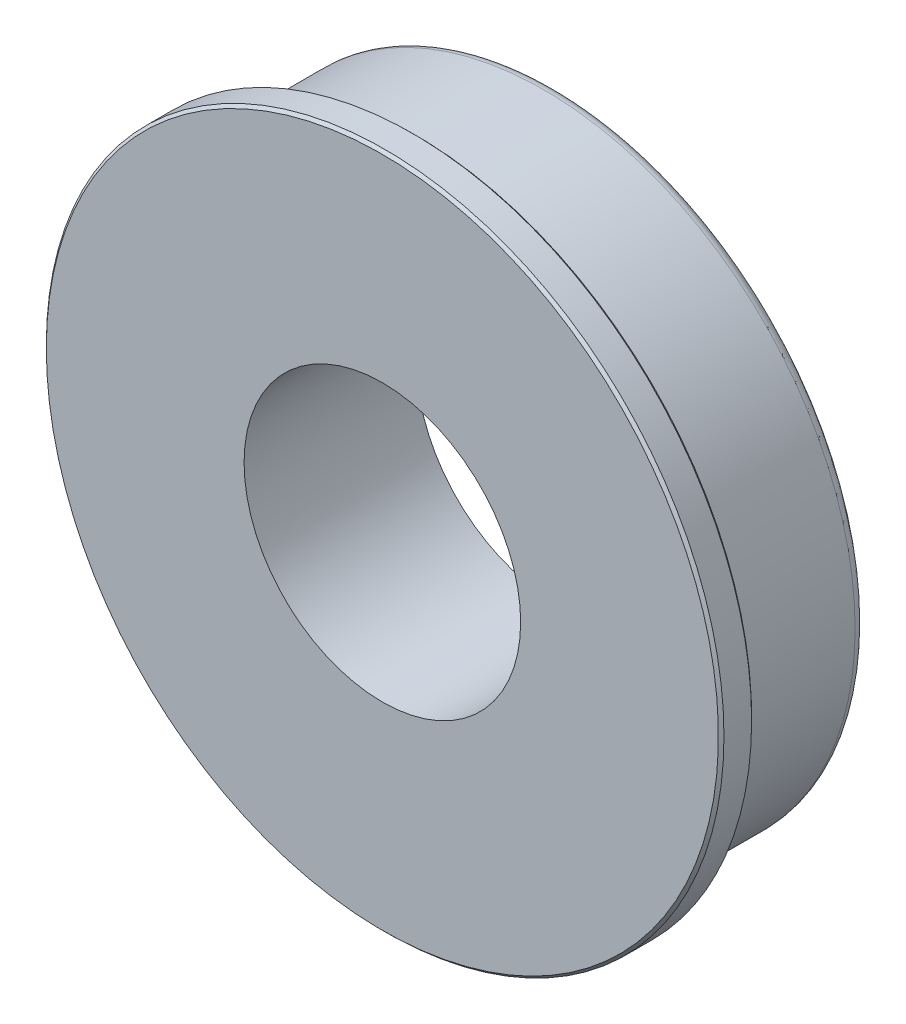
ISO-10303-21;
HEADER;
FILE_DESCRIPTION(('STEP AP214'),'2;1');
FILE_NAME('part.step','',(''),(''),'','','');
FILE_SCHEMA(('AUTOMOTIVE_DESIGN { 1 0 10303 214 1 1 1 1 }'));
ENDSEC;
DATA;
#1=APPLICATION_CONTEXT('core data for automotive mechanical design processes');
#2=APPLICATION_PROTOCOL_DEFINITION('international standard','automotive_design',2000,#1);
#3=PRODUCT_CONTEXT('',#1,'mechanical');
#4=PRODUCT('Part','Part','',(#3));
#5=PRODUCT_RELATED_PRODUCT_CATEGORY('part','',(#4));
#6=PRODUCT_DEFINITION_FORMATION('','',#4);
#7=PRODUCT_DEFINITION_CONTEXT('part definition',#1,'design');
#8=PRODUCT_DEFINITION('design','',#6,#7);
#9=PRODUCT_DEFINITION_SHAPE('','',#8);
#10=(LENGTH_UNIT() NAMED_UNIT(*) SI_UNIT(.MILLI.,.METRE.));
#11=(NAMED_UNIT(*) PLANE_ANGLE_UNIT() SI_UNIT($,.RADIAN.));
#12=(NAMED_UNIT(*) SI_UNIT($,.STERADIAN.) SOLID_ANGLE_UNIT());
#13=UNCERTAINTY_MEASURE_WITH_UNIT(LENGTH_MEASURE(1.E-05),#10,'distance_accuracy_value','');
#14=(GEOMETRIC_REPRESENTATION_CONTEXT(3) GLOBAL_UNCERTAINTY_ASSIGNED_CONTEXT((#13)) GLOBAL_UNIT_ASSIGNED_CONTEXT((#10,
#11,#12)) REPRESENTATION_CONTEXT('',''));
#15=CARTESIAN_POINT('',(0.,0.,0.));
#16=DIRECTION('',(0.,0.,1.));
#17=DIRECTION('',(1.,0.,0.));
#18=AXIS2_PLACEMENT_3D('',#15,#16,#17);
#19=CARTESIAN_POINT('',(0.,47.3069264516129,5.89534));
#20=DIRECTION('',(0.,0.,-1.));
#21=DIRECTION('',(-1.,0.,0.));
#22=AXIS2_PLACEMENT_3D('',#19,#20,#21);
#23=PLANE('',#22);
#24=CARTESIAN_POINT('',(0.,0.,5.89534));
#25=DIRECTION('',(0.,0.,1.));
#26=DIRECTION('',(1.,0.,0.));
#27=AXIS2_PLACEMENT_3D('',#24,#25,#26);
#28=CIRCLE('',#27,14.2875);
#29=CARTESIAN_POINT('',(14.2875,0.,5.89534));
#30=VERTEX_POINT('',#29);
#31=EDGE_CURVE('E47',#30,#30,#28,.F.);
#32=ORIENTED_EDGE('',*,*,#31,.F.);
#33=EDGE_LOOP('',(#32));
#34=FACE_BOUND('',#33,.T.);
#35=CARTESIAN_POINT('',(0.,0.,5.89534));
#36=DIRECTION('',(0.,0.,-1.));
#37=DIRECTION('',(-1.,0.,0.));
#38=AXIS2_PLACEMENT_3D('',#35,#36,#37);
#39=CIRCLE('',#38,13.97);
#40=CARTESIAN_POINT('',(-13.97,0.,5.89534));
#41=VERTEX_POINT('',#40);
#42=EDGE_CURVE('E20',#41,#41,#39,.F.);
#43=ORIENTED_EDGE('',*,*,#42,.F.);
#44=EDGE_LOOP('',(#43));
#45=FACE_BOUND('',#44,.T.);
#46=ADVANCED_FACE('F16',(#34,#45),#23,.F.);
#47=CARTESIAN_POINT('',(0.,0.,-57.007125));
#48=DIRECTION('',(0.,0.,-1.));
#49=DIRECTION('',(-1.,0.,0.));
#50=AXIS2_PLACEMENT_3D('',#47,#48,#49);
#51=CYLINDRICAL_SURFACE('',#50,13.97);
#52=ORIENTED_EDGE('',*,*,#42,.T.);
#53=EDGE_LOOP('',(#52));
#54=FACE_BOUND('',#53,.T.);
#55=CARTESIAN_POINT('',(0.,0.,6.40333999999999));
#56=DIRECTION('',(0.,0.,-1.));
#57=DIRECTION('',(-1.,0.,0.));
#58=AXIS2_PLACEMENT_3D('',#55,#56,#57);
#59=CIRCLE('',#58,13.97);
#60=CARTESIAN_POINT('',(-13.97,0.,6.40333999999999));
#61=VERTEX_POINT('',#60);
#62=EDGE_CURVE('E45',#61,#61,#59,.F.);
#63=ORIENTED_EDGE('',*,*,#62,.F.);
#64=EDGE_LOOP('',(#63));
#65=FACE_BOUND('',#64,.T.);
#66=ADVANCED_FACE('F54',(#54,#65),#51,.T.);
#67=CARTESIAN_POINT('',(0.,0.,6.40334));
#68=DIRECTION('',(0.,0.,1.));
#69=DIRECTION('',(1.,0.,0.));
#70=AXIS2_PLACEMENT_3D('',#67,#68,#69);
#71=CYLINDRICAL_SURFACE('',#70,14.2875);
#72=CARTESIAN_POINT('',(0.,0.,0.508));
#73=DIRECTION('',(0.,0.,-1.));
#74=DIRECTION('',(-1.,0.,0.));
#75=AXIS2_PLACEMENT_3D('',#72,#73,#74);
#76=CIRCLE('',#75,14.2875);
#77=CARTESIAN_POINT('',(-14.2875,0.,0.508));
#78=VERTEX_POINT('',#77);
#79=EDGE_CURVE('E32',#78,#78,#76,.T.);
#80=ORIENTED_EDGE('',*,*,#79,.F.);
#81=EDGE_LOOP('',(#80));
#82=FACE_BOUND('',#81,.T.);
#83=ORIENTED_EDGE('',*,*,#31,.T.);
#84=EDGE_LOOP('',(#83));
#85=FACE_BOUND('',#84,.T.);
#86=ADVANCED_FACE('F62',(#82,#85),#71,.T.);
#87=CARTESIAN_POINT('',(0.,0.,6.40334));
#88=DIRECTION('',(0.,0.,-1.));
#89=DIRECTION('',(-1.,0.,0.));
#90=AXIS2_PLACEMENT_3D('',#87,#88,#89);
#91=PLANE('',#90);
#92=CARTESIAN_POINT('',(0.,0.,6.40334000000001));
#93=DIRECTION('',(0.,0.,1.));
#94=DIRECTION('',(0.,-1.,0.));
#95=AXIS2_PLACEMENT_3D('',#92,#93,#94);
#96=CIRCLE('',#95,15.4305);
#97=CARTESIAN_POINT('',(0.,-15.4305,6.40334000000001));
#98=VERTEX_POINT('',#97);
#99=EDGE_CURVE('E42',#98,#98,#96,.T.);
#100=ORIENTED_EDGE('',*,*,#99,.F.);
#101=EDGE_LOOP('',(#100));
#102=FACE_BOUND('',#101,.T.);
#103=ORIENTED_EDGE('',*,*,#62,.T.);
#104=EDGE_LOOP('',(#103));
#105=FACE_BOUND('',#104,.T.);
#106=ADVANCED_FACE('F92',(#102,#105),#91,.T.);
#107=CARTESIAN_POINT('',(0.,0.,0.508000000000006));
#108=DIRECTION('',(0.,0.,-1.));
#109=DIRECTION('',(-1.,0.,0.));
#110=AXIS2_PLACEMENT_3D('',#107,#108,#109);
#111=TOROIDAL_SURFACE('',#110,13.7795,0.508000000000003);
#112=ORIENTED_EDGE('',*,*,#79,.T.);
#113=EDGE_LOOP('',(#112));
#114=FACE_BOUND('',#113,.T.);
#115=CARTESIAN_POINT('',(0.,0.,0.));
#116=DIRECTION('',(0.,0.,-1.));
#117=DIRECTION('',(-1.,0.,0.));
#118=AXIS2_PLACEMENT_3D('',#115,#116,#117);
#119=CIRCLE('',#118,13.7795);
#120=CARTESIAN_POINT('',(-13.7795,0.,0.));
#121=VERTEX_POINT('',#120);
#122=EDGE_CURVE('E39',#121,#121,#119,.T.);
#123=ORIENTED_EDGE('',*,*,#122,.F.);
#124=EDGE_LOOP('',(#123));
#125=FACE_BOUND('',#124,.T.);
#126=ADVANCED_FACE('F18',(#114,#125),#111,.T.);
#127=CARTESIAN_POINT('',(0.,0.,6.53034));
#128=DIRECTION('',(0.,0.,1.));
#129=DIRECTION('',(0.,-1.,0.));
#130=AXIS2_PLACEMENT_3D('',#127,#128,#129);
#131=CONICAL_SURFACE('',#130,15.5575000000007,0.785398163400003);
#132=CARTESIAN_POINT('',(0.,0.,6.53034));
#133=DIRECTION('',(0.,0.,1.));
#134=DIRECTION('',(1.,0.,0.));
#135=AXIS2_PLACEMENT_3D('',#132,#133,#134);
#136=CIRCLE('',#135,15.5575);
#137=CARTESIAN_POINT('',(15.5575,0.,6.53034));
#138=VERTEX_POINT('',#137);
#139=EDGE_CURVE('E38',#138,#138,#136,.T.);
#140=ORIENTED_EDGE('',*,*,#139,.F.);
#141=EDGE_LOOP('',(#140));
#142=FACE_BOUND('',#141,.T.);
#143=ORIENTED_EDGE('',*,*,#99,.T.);
#144=EDGE_LOOP('',(#143));
#145=FACE_BOUND('',#144,.T.);
#146=ADVANCED_FACE('F87',(#142,#145),#131,.T.);
#147=CARTESIAN_POINT('',(0.,0.,0.));
#148=DIRECTION('',(0.,0.,-1.));
#149=DIRECTION('',(-1.,0.,0.));
#150=AXIS2_PLACEMENT_3D('',#147,#148,#149);
#151=PLANE('',#150);
#152=ORIENTED_EDGE('',*,*,#122,.T.);
#153=EDGE_LOOP('',(#152));
#154=FACE_BOUND('',#153,.T.);
#155=CARTESIAN_POINT('',(0.,0.,0.));
#156=DIRECTION('',(0.,0.,-1.));
#157=DIRECTION('',(-1.,0.,0.));
#158=AXIS2_PLACEMENT_3D('',#155,#156,#157);
#159=CIRCLE('',#158,6.35);
#160=CARTESIAN_POINT('',(-6.34999999999999,0.,0.));
#161=VERTEX_POINT('',#160);
#162=EDGE_CURVE('E35',#161,#161,#159,.F.);
#163=ORIENTED_EDGE('',*,*,#162,.T.);
#164=EDGE_LOOP('',(#163));
#165=FACE_BOUND('',#164,.T.);
#166=ADVANCED_FACE('F83',(#154,#165),#151,.T.);
#167=CARTESIAN_POINT('',(0.,0.,7.92734));
#168=DIRECTION('',(0.,0.,1.));
#169=DIRECTION('',(1.,0.,0.));
#170=AXIS2_PLACEMENT_3D('',#167,#168,#169);
#171=CYLINDRICAL_SURFACE('',#170,15.5575);
#172=CARTESIAN_POINT('',(0.,0.,7.80033999999999));
#173=DIRECTION('',(0.,0.,-1.));
#174=DIRECTION('',(-1.,0.,0.));
#175=AXIS2_PLACEMENT_3D('',#172,#173,#174);
#176=CIRCLE('',#175,15.5575);
#177=CARTESIAN_POINT('',(-15.5575,0.,7.80033999999999));
#178=VERTEX_POINT('',#177);
#179=EDGE_CURVE('E29',#178,#178,#176,.F.);
#180=ORIENTED_EDGE('',*,*,#179,.F.);
#181=EDGE_LOOP('',(#180));
#182=FACE_BOUND('',#181,.T.);
#183=ORIENTED_EDGE('',*,*,#139,.T.);
#184=EDGE_LOOP('',(#183));
#185=FACE_BOUND('',#184,.T.);
#186=ADVANCED_FACE('F79',(#182,#185),#171,.T.);
#187=CARTESIAN_POINT('',(0.,0.,7.92734));
#188=DIRECTION('',(0.,0.,-1.));
#189=DIRECTION('',(-1.,0.,0.));
#190=AXIS2_PLACEMENT_3D('',#187,#188,#189);
#191=CYLINDRICAL_SURFACE('',#190,6.35);
#192=ORIENTED_EDGE('',*,*,#162,.F.);
#193=EDGE_LOOP('',(#192));
#194=FACE_BOUND('',#193,.T.);
#195=CARTESIAN_POINT('',(0.,0.,7.92734));
#196=DIRECTION('',(0.,0.,-1.));
#197=DIRECTION('',(-1.,0.,0.));
#198=AXIS2_PLACEMENT_3D('',#195,#196,#197);
#199=CIRCLE('',#198,6.35);
#200=CARTESIAN_POINT('',(-6.34999999999999,0.,7.92734));
#201=VERTEX_POINT('',#200);
#202=EDGE_CURVE('E24',#201,#201,#199,.F.);
#203=ORIENTED_EDGE('',*,*,#202,.T.);
#204=EDGE_LOOP('',(#203));
#205=FACE_BOUND('',#204,.T.);
#206=ADVANCED_FACE('F72',(#194,#205),#191,.F.);
#207=CARTESIAN_POINT('',(0.,0.,7.80033999999999));
#208=DIRECTION('',(0.,0.,-1.));
#209=DIRECTION('',(-1.,0.,0.));
#210=AXIS2_PLACEMENT_3D('',#207,#208,#209);
#211=CONICAL_SURFACE('',#210,15.5575,0.785398163400003);
#212=ORIENTED_EDGE('',*,*,#179,.T.);
#213=EDGE_LOOP('',(#212));
#214=FACE_BOUND('',#213,.T.);
#215=CARTESIAN_POINT('',(0.,0.,7.92733999999967));
#216=DIRECTION('',(0.,0.,-1.));
#217=DIRECTION('',(-1.,0.,0.));
#218=AXIS2_PLACEMENT_3D('',#215,#216,#217);
#219=CIRCLE('',#218,15.4304999999997);
#220=CARTESIAN_POINT('',(-15.4304999999997,0.,7.92733999999967));
#221=VERTEX_POINT('',#220);
#222=EDGE_CURVE('E10',#221,#221,#219,.T.);
#223=ORIENTED_EDGE('',*,*,#222,.T.);
#224=EDGE_LOOP('',(#223));
#225=FACE_BOUND('',#224,.T.);
#226=ADVANCED_FACE('F66',(#214,#225),#211,.T.);
#227=CARTESIAN_POINT('',(0.,0.,7.92734));
#228=DIRECTION('',(0.,0.,-1.));
#229=DIRECTION('',(-1.,0.,0.));
#230=AXIS2_PLACEMENT_3D('',#227,#228,#229);
#231=PLANE('',#230);
#232=ORIENTED_EDGE('',*,*,#222,.F.);
#233=EDGE_LOOP('',(#232));
#234=FACE_BOUND('',#233,.T.);
#235=ORIENTED_EDGE('',*,*,#202,.F.);
#236=EDGE_LOOP('',(#235));
#237=FACE_BOUND('',#236,.T.);
#238=ADVANCED_FACE('F64',(#234,#237),#231,.F.);
#239=CLOSED_SHELL('',(#46,#66,#86,#106,#126,#146,#166,#186,#206,#226,#238));
#240=MANIFOLD_SOLID_BREP('B1',#239);
#241=ADVANCED_BREP_SHAPE_REPRESENTATION('',(#18,#240),#14);
#242=SHAPE_DEFINITION_REPRESENTATION(#9,#241);
ENDSEC;
END-ISO-10303-21;
